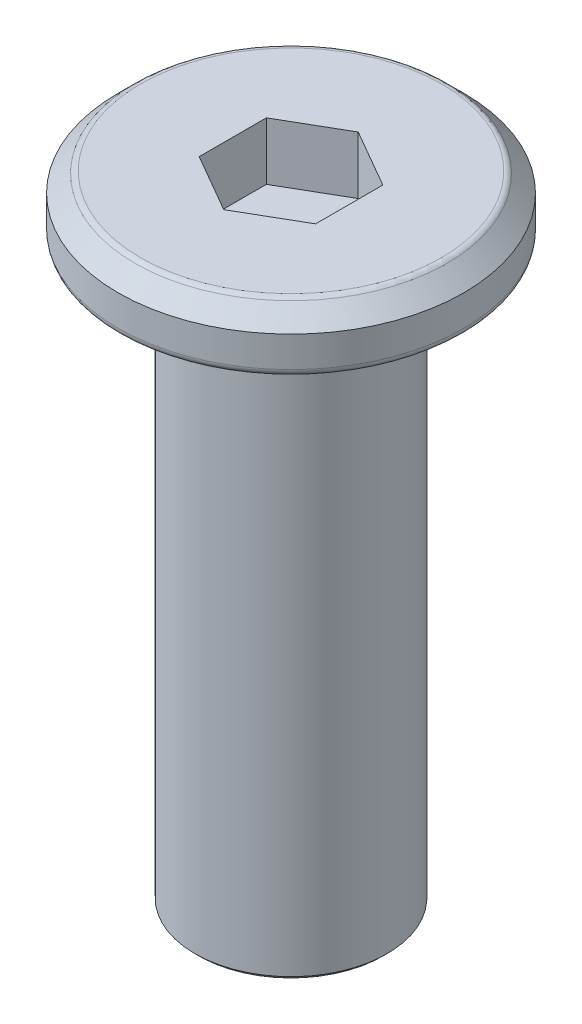
ISO-10303-21;
HEADER;
FILE_DESCRIPTION(('STEP AP214'),'2;1');
FILE_NAME('part.step','',(''),(''),'','','');
FILE_SCHEMA(('AUTOMOTIVE_DESIGN { 1 0 10303 214 1 1 1 1 }'));
ENDSEC;
DATA;
#1=APPLICATION_CONTEXT('core data for automotive mechanical design processes');
#2=APPLICATION_PROTOCOL_DEFINITION('international standard','automotive_design',2000,#1);
#3=PRODUCT_CONTEXT('',#1,'mechanical');
#4=PRODUCT('Part','Part','',(#3));
#5=PRODUCT_RELATED_PRODUCT_CATEGORY('part','',(#4));
#6=PRODUCT_DEFINITION_FORMATION('','',#4);
#7=PRODUCT_DEFINITION_CONTEXT('part definition',#1,'design');
#8=PRODUCT_DEFINITION('design','',#6,#7);
#9=PRODUCT_DEFINITION_SHAPE('','',#8);
#10=(LENGTH_UNIT() NAMED_UNIT(*) SI_UNIT(.MILLI.,.METRE.));
#11=(NAMED_UNIT(*) PLANE_ANGLE_UNIT() SI_UNIT($,.RADIAN.));
#12=(NAMED_UNIT(*) SI_UNIT($,.STERADIAN.) SOLID_ANGLE_UNIT());
#13=UNCERTAINTY_MEASURE_WITH_UNIT(LENGTH_MEASURE(1.E-05),#10,'distance_accuracy_value','');
#14=(GEOMETRIC_REPRESENTATION_CONTEXT(3) GLOBAL_UNCERTAINTY_ASSIGNED_CONTEXT((#13)) GLOBAL_UNIT_ASSIGNED_CONTEXT((#10,
#11,#12)) REPRESENTATION_CONTEXT('',''));
#15=CARTESIAN_POINT('',(0.,0.,0.));
#16=DIRECTION('',(0.,0.,1.));
#17=DIRECTION('',(1.,0.,0.));
#18=AXIS2_PLACEMENT_3D('',#15,#16,#17);
#19=CARTESIAN_POINT('',(0.,1.5,0.));
#20=DIRECTION('',(0.,-1.,0.));
#21=DIRECTION('',(0.,0.,-1.));
#22=AXIS2_PLACEMENT_3D('',#19,#20,#21);
#23=CYLINDRICAL_SURFACE('',#22,4.5);
#24=CARTESIAN_POINT('',(0.,0.2,0.));
#25=DIRECTION('',(0.,1.,0.));
#26=DIRECTION('',(0.,0.,1.));
#27=AXIS2_PLACEMENT_3D('',#24,#25,#26);
#28=CIRCLE('',#27,4.5);
#29=CARTESIAN_POINT('',(0.,0.2,4.5));
#30=VERTEX_POINT('',#29);
#31=EDGE_CURVE('E131',#30,#30,#28,.T.);
#32=ORIENTED_EDGE('',*,*,#31,.T.);
#33=EDGE_LOOP('',(#32));
#34=FACE_BOUND('',#33,.T.);
#35=CARTESIAN_POINT('',(0.,0.999999999999997,0.));
#36=DIRECTION('',(0.,1.,0.));
#37=DIRECTION('',(0.,0.,1.));
#38=AXIS2_PLACEMENT_3D('',#35,#36,#37);
#39=CIRCLE('',#38,4.5);
#40=CARTESIAN_POINT('',(0.,0.999999999999997,4.5));
#41=VERTEX_POINT('',#40);
#42=EDGE_CURVE('E117',#41,#41,#39,.F.);
#43=ORIENTED_EDGE('',*,*,#42,.T.);
#44=EDGE_LOOP('',(#43));
#45=FACE_BOUND('',#44,.T.);
#46=ADVANCED_FACE('F16',(#34,#45),#23,.T.);
#47=CARTESIAN_POINT('',(0.,1.5,0.));
#48=DIRECTION('',(0.,1.,0.));
#49=DIRECTION('',(0.,0.,1.));
#50=AXIS2_PLACEMENT_3D('',#47,#48,#49);
#51=PLANE('',#50);
#52=CARTESIAN_POINT('',(0.,1.5,0.));
#53=DIRECTION('',(0.,1.,0.));
#54=DIRECTION('',(0.,0.,1.));
#55=AXIS2_PLACEMENT_3D('',#52,#53,#54);
#56=CIRCLE('',#55,3.91715728752538);
#57=CARTESIAN_POINT('',(0.,1.5,3.91715728752538));
#58=VERTEX_POINT('',#57);
#59=EDGE_CURVE('E125',#58,#58,#56,.T.);
#60=ORIENTED_EDGE('',*,*,#59,.T.);
#61=EDGE_LOOP('',(#60));
#62=FACE_BOUND('',#61,.T.);
#63=DIRECTION('',(-0.866025403784438,0.,-0.5));
#64=VECTOR('',#63,1.);
#65=CARTESIAN_POINT('',(1.51554445662277,1.5,-0.875));
#66=LINE('',#65,#64);
#67=CARTESIAN_POINT('',(1.51554445662277,1.5,-0.875));
#68=VERTEX_POINT('',#67);
#69=CARTESIAN_POINT('',(0.,1.5,-1.75));
#70=VERTEX_POINT('',#69);
#71=EDGE_CURVE('E32',#68,#70,#66,.T.);
#72=ORIENTED_EDGE('',*,*,#71,.F.);
#73=DIRECTION('',(0.,0.,-1.));
#74=VECTOR('',#73,1.);
#75=CARTESIAN_POINT('',(1.51554445662277,1.5,0.875000000000001));
#76=LINE('',#75,#74);
#77=CARTESIAN_POINT('',(1.51554445662277,1.5,0.875000000000001));
#78=VERTEX_POINT('',#77);
#79=EDGE_CURVE('E113',#78,#68,#76,.T.);
#80=ORIENTED_EDGE('',*,*,#79,.F.);
#81=DIRECTION('',(0.866025403784439,0.,-0.5));
#82=VECTOR('',#81,1.);
#83=CARTESIAN_POINT('',(0.,1.5,1.75));
#84=LINE('',#83,#82);
#85=CARTESIAN_POINT('',(0.,1.5,1.75));
#86=VERTEX_POINT('',#85);
#87=EDGE_CURVE('E111',#86,#78,#84,.T.);
#88=ORIENTED_EDGE('',*,*,#87,.F.);
#89=DIRECTION('',(0.866025403784438,0.,0.5));
#90=VECTOR('',#89,1.);
#91=CARTESIAN_POINT('',(-1.51554445662277,1.5,0.874999999999999));
#92=LINE('',#91,#90);
#93=CARTESIAN_POINT('',(-1.51554445662277,1.5,0.874999999999999));
#94=VERTEX_POINT('',#93);
#95=EDGE_CURVE('E79',#94,#86,#92,.T.);
#96=ORIENTED_EDGE('',*,*,#95,.F.);
#97=DIRECTION('',(0.,0.,1.));
#98=VECTOR('',#97,1.);
#99=CARTESIAN_POINT('',(-1.51554445662277,1.5,-0.875));
#100=LINE('',#99,#98);
#101=CARTESIAN_POINT('',(-1.51554445662277,1.5,-0.875));
#102=VERTEX_POINT('',#101);
#103=EDGE_CURVE('E107',#102,#94,#100,.T.);
#104=ORIENTED_EDGE('',*,*,#103,.F.);
#105=DIRECTION('',(-0.866025403784439,0.,0.5));
#106=VECTOR('',#105,1.);
#107=CARTESIAN_POINT('',(0.,1.5,-1.75));
#108=LINE('',#107,#106);
#109=EDGE_CURVE('E104',#70,#102,#108,.T.);
#110=ORIENTED_EDGE('',*,*,#109,.F.);
#111=EDGE_LOOP('',(#72,#80,#88,#96,#104,#110));
#112=FACE_BOUND('',#111,.T.);
#113=ADVANCED_FACE('F158',(#62,#112),#51,.T.);
#114=CARTESIAN_POINT('',(0.,0.,0.));
#115=DIRECTION('',(0.,1.,0.));
#116=DIRECTION('',(0.,0.,1.));
#117=AXIS2_PLACEMENT_3D('',#114,#115,#116);
#118=PLANE('',#117);
#119=CARTESIAN_POINT('',(0.,0.,0.));
#120=DIRECTION('',(0.,1.,0.));
#121=DIRECTION('',(0.,0.,1.));
#122=AXIS2_PLACEMENT_3D('',#119,#120,#121);
#123=CIRCLE('',#122,2.75);
#124=CARTESIAN_POINT('',(0.,0.,2.75));
#125=VERTEX_POINT('',#124);
#126=EDGE_CURVE('E140',#125,#125,#123,.T.);
#127=ORIENTED_EDGE('',*,*,#126,.T.);
#128=EDGE_LOOP('',(#127));
#129=FACE_BOUND('',#128,.T.);
#130=CARTESIAN_POINT('',(0.,0.,0.));
#131=DIRECTION('',(0.,1.,0.));
#132=DIRECTION('',(0.,0.,1.));
#133=AXIS2_PLACEMENT_3D('',#130,#131,#132);
#134=CIRCLE('',#133,4.3);
#135=CARTESIAN_POINT('',(0.,0.,4.3));
#136=VERTEX_POINT('',#135);
#137=EDGE_CURVE('E134',#136,#136,#134,.F.);
#138=ORIENTED_EDGE('',*,*,#137,.T.);
#139=EDGE_LOOP('',(#138));
#140=FACE_BOUND('',#139,.T.);
#141=ADVANCED_FACE('F164',(#129,#140),#118,.F.);
#142=CARTESIAN_POINT('',(0.,1.5,0.));
#143=DIRECTION('',(0.,-1.,0.));
#144=DIRECTION('',(0.,0.,-1.));
#145=AXIS2_PLACEMENT_3D('',#142,#143,#144);
#146=CONICAL_SURFACE('',#145,4.,0.785398163397447);
#147=CARTESIAN_POINT('',(0.,1.44142135623731,0.));
#148=DIRECTION('',(0.,1.,0.));
#149=DIRECTION('',(0.,0.,1.));
#150=AXIS2_PLACEMENT_3D('',#147,#148,#149);
#151=CIRCLE('',#150,4.05857864376269);
#152=CARTESIAN_POINT('',(0.,1.44142135623731,4.05857864376269));
#153=VERTEX_POINT('',#152);
#154=EDGE_CURVE('E128',#153,#153,#151,.F.);
#155=ORIENTED_EDGE('',*,*,#154,.T.);
#156=EDGE_LOOP('',(#155));
#157=FACE_BOUND('',#156,.T.);
#158=ORIENTED_EDGE('',*,*,#42,.F.);
#159=EDGE_LOOP('',(#158));
#160=FACE_BOUND('',#159,.T.);
#161=ADVANCED_FACE('F170',(#157,#160),#146,.T.);
#162=CARTESIAN_POINT('',(1.51554445662277,0.,-0.875));
#163=DIRECTION('',(0.5,0.,-0.866025403784439));
#164=DIRECTION('',(-0.866025403784439,0.,-0.5));
#165=AXIS2_PLACEMENT_3D('',#162,#163,#164);
#166=PLANE('',#165);
#167=ORIENTED_EDGE('',*,*,#71,.T.);
#168=DIRECTION('',(0.,1.,0.));
#169=VECTOR('',#168,1.);
#170=CARTESIAN_POINT('',(0.,0.,-1.75));
#171=LINE('',#170,#169);
#172=CARTESIAN_POINT('',(0.,0.,-1.75));
#173=VERTEX_POINT('',#172);
#174=EDGE_CURVE('E63',#173,#70,#171,.T.);
#175=ORIENTED_EDGE('',*,*,#174,.F.);
#176=DIRECTION('',(-0.866025403784438,0.,-0.5));
#177=VECTOR('',#176,1.);
#178=CARTESIAN_POINT('',(1.51554445662277,0.,-0.875));
#179=LINE('',#178,#177);
#180=CARTESIAN_POINT('',(1.51554445662277,0.,-0.875));
#181=VERTEX_POINT('',#180);
#182=EDGE_CURVE('E115',#181,#173,#179,.T.);
#183=ORIENTED_EDGE('',*,*,#182,.F.);
#184=DIRECTION('',(0.,1.,0.));
#185=VECTOR('',#184,1.);
#186=CARTESIAN_POINT('',(1.51554445662277,0.,-0.875));
#187=LINE('',#186,#185);
#188=EDGE_CURVE('E40',#181,#68,#187,.T.);
#189=ORIENTED_EDGE('',*,*,#188,.T.);
#190=EDGE_LOOP('',(#167,#175,#183,#189));
#191=FACE_BOUND('',#190,.T.);
#192=ADVANCED_FACE('F173',(#191),#166,.F.);
#193=CARTESIAN_POINT('',(1.51554445662277,0.,0.875000000000001));
#194=DIRECTION('',(1.,0.,0.));
#195=DIRECTION('',(0.,0.,-1.));
#196=AXIS2_PLACEMENT_3D('',#193,#194,#195);
#197=PLANE('',#196);
#198=ORIENTED_EDGE('',*,*,#79,.T.);
#199=ORIENTED_EDGE('',*,*,#188,.F.);
#200=DIRECTION('',(0.,0.,-1.));
#201=VECTOR('',#200,1.);
#202=CARTESIAN_POINT('',(1.51554445662277,0.,0.875000000000001));
#203=LINE('',#202,#201);
#204=CARTESIAN_POINT('',(1.51554445662277,0.,0.875000000000001));
#205=VERTEX_POINT('',#204);
#206=EDGE_CURVE('E91',#205,#181,#203,.T.);
#207=ORIENTED_EDGE('',*,*,#206,.F.);
#208=DIRECTION('',(0.,1.,0.));
#209=VECTOR('',#208,1.);
#210=CARTESIAN_POINT('',(1.51554445662277,0.,0.875000000000001));
#211=LINE('',#210,#209);
#212=EDGE_CURVE('E83',#205,#78,#211,.T.);
#213=ORIENTED_EDGE('',*,*,#212,.T.);
#214=EDGE_LOOP('',(#198,#199,#207,#213));
#215=FACE_BOUND('',#214,.T.);
#216=ADVANCED_FACE('F207',(#215),#197,.F.);
#217=CARTESIAN_POINT('',(0.,0.,1.75));
#218=DIRECTION('',(0.5,0.,0.866025403784439));
#219=DIRECTION('',(0.866025403784439,0.,-0.5));
#220=AXIS2_PLACEMENT_3D('',#217,#218,#219);
#221=PLANE('',#220);
#222=ORIENTED_EDGE('',*,*,#87,.T.);
#223=ORIENTED_EDGE('',*,*,#212,.F.);
#224=DIRECTION('',(0.866025403784439,0.,-0.5));
#225=VECTOR('',#224,1.);
#226=CARTESIAN_POINT('',(0.,0.,1.75));
#227=LINE('',#226,#225);
#228=CARTESIAN_POINT('',(0.,0.,1.75));
#229=VERTEX_POINT('',#228);
#230=EDGE_CURVE('E87',#229,#205,#227,.T.);
#231=ORIENTED_EDGE('',*,*,#230,.F.);
#232=DIRECTION('',(0.,1.,0.));
#233=VECTOR('',#232,1.);
#234=CARTESIAN_POINT('',(0.,0.,1.75));
#235=LINE('',#234,#233);
#236=EDGE_CURVE('E72',#229,#86,#235,.T.);
#237=ORIENTED_EDGE('',*,*,#236,.T.);
#238=EDGE_LOOP('',(#222,#223,#231,#237));
#239=FACE_BOUND('',#238,.T.);
#240=ADVANCED_FACE('F88',(#239),#221,.F.);
#241=CARTESIAN_POINT('',(-1.51554445662277,0.,0.874999999999999));
#242=DIRECTION('',(-0.5,0.,0.866025403784438));
#243=DIRECTION('',(0.866025403784439,0.,0.5));
#244=AXIS2_PLACEMENT_3D('',#241,#242,#243);
#245=PLANE('',#244);
#246=ORIENTED_EDGE('',*,*,#95,.T.);
#247=ORIENTED_EDGE('',*,*,#236,.F.);
#248=DIRECTION('',(0.866025403784438,0.,0.5));
#249=VECTOR('',#248,1.);
#250=CARTESIAN_POINT('',(-1.51554445662277,0.,0.874999999999999));
#251=LINE('',#250,#249);
#252=CARTESIAN_POINT('',(-1.51554445662277,0.,0.874999999999999));
#253=VERTEX_POINT('',#252);
#254=EDGE_CURVE('E76',#253,#229,#251,.T.);
#255=ORIENTED_EDGE('',*,*,#254,.F.);
#256=DIRECTION('',(0.,1.,0.));
#257=VECTOR('',#256,1.);
#258=CARTESIAN_POINT('',(-1.51554445662277,0.,0.874999999999999));
#259=LINE('',#258,#257);
#260=EDGE_CURVE('E84',#253,#94,#259,.T.);
#261=ORIENTED_EDGE('',*,*,#260,.T.);
#262=EDGE_LOOP('',(#246,#247,#255,#261));
#263=FACE_BOUND('',#262,.T.);
#264=ADVANCED_FACE('F74',(#263),#245,.F.);
#265=CARTESIAN_POINT('',(-1.51554445662277,0.,-0.875));
#266=DIRECTION('',(-1.,0.,0.));
#267=DIRECTION('',(0.,0.,1.));
#268=AXIS2_PLACEMENT_3D('',#265,#266,#267);
#269=PLANE('',#268);
#270=ORIENTED_EDGE('',*,*,#103,.T.);
#271=ORIENTED_EDGE('',*,*,#260,.F.);
#272=DIRECTION('',(0.,0.,1.));
#273=VECTOR('',#272,1.);
#274=CARTESIAN_POINT('',(-1.51554445662277,0.,-0.875));
#275=LINE('',#274,#273);
#276=CARTESIAN_POINT('',(-1.51554445662277,0.,-0.875000000000001));
#277=VERTEX_POINT('',#276);
#278=EDGE_CURVE('E96',#277,#253,#275,.T.);
#279=ORIENTED_EDGE('',*,*,#278,.F.);
#280=DIRECTION('',(0.,1.,0.));
#281=VECTOR('',#280,1.);
#282=CARTESIAN_POINT('',(-1.51554445662277,0.,-0.875));
#283=LINE('',#282,#281);
#284=EDGE_CURVE('E120',#277,#102,#283,.T.);
#285=ORIENTED_EDGE('',*,*,#284,.T.);
#286=EDGE_LOOP('',(#270,#271,#279,#285));
#287=FACE_BOUND('',#286,.T.);
#288=ADVANCED_FACE('F214',(#287),#269,.F.);
#289=CARTESIAN_POINT('',(0.,0.,-1.75));
#290=DIRECTION('',(-0.5,0.,-0.866025403784439));
#291=DIRECTION('',(-0.866025403784439,0.,0.5));
#292=AXIS2_PLACEMENT_3D('',#289,#290,#291);
#293=PLANE('',#292);
#294=ORIENTED_EDGE('',*,*,#109,.T.);
#295=ORIENTED_EDGE('',*,*,#284,.F.);
#296=DIRECTION('',(-0.866025403784439,0.,0.5));
#297=VECTOR('',#296,1.);
#298=CARTESIAN_POINT('',(0.,0.,-1.75));
#299=LINE('',#298,#297);
#300=EDGE_CURVE('E98',#173,#277,#299,.T.);
#301=ORIENTED_EDGE('',*,*,#300,.F.);
#302=ORIENTED_EDGE('',*,*,#174,.T.);
#303=EDGE_LOOP('',(#294,#295,#301,#302));
#304=FACE_BOUND('',#303,.T.);
#305=ADVANCED_FACE('F204',(#304),#293,.F.);
#306=CARTESIAN_POINT('',(0.,0.,0.));
#307=DIRECTION('',(0.,-1.,0.));
#308=DIRECTION('',(0.,0.,-1.));
#309=AXIS2_PLACEMENT_3D('',#306,#307,#308);
#310=PLANE('',#309);
#311=ORIENTED_EDGE('',*,*,#206,.T.);
#312=ORIENTED_EDGE('',*,*,#182,.T.);
#313=ORIENTED_EDGE('',*,*,#300,.T.);
#314=ORIENTED_EDGE('',*,*,#278,.T.);
#315=ORIENTED_EDGE('',*,*,#254,.T.);
#316=ORIENTED_EDGE('',*,*,#230,.T.);
#317=EDGE_LOOP('',(#311,#312,#313,#314,#315,#316));
#318=FACE_BOUND('',#317,.T.);
#319=ADVANCED_FACE('F93',(#318),#310,.F.);
#320=CARTESIAN_POINT('',(0.,-15.,0.));
#321=DIRECTION('',(0.,1.,0.));
#322=DIRECTION('',(0.,0.,1.));
#323=AXIS2_PLACEMENT_3D('',#320,#321,#322);
#324=CYLINDRICAL_SURFACE('',#323,2.5);
#325=CARTESIAN_POINT('',(0.,-14.9,0.));
#326=DIRECTION('',(0.,-1.,0.));
#327=DIRECTION('',(0.,0.,-1.));
#328=AXIS2_PLACEMENT_3D('',#325,#326,#327);
#329=CIRCLE('',#328,2.5);
#330=CARTESIAN_POINT('',(0.,-14.9,-2.5));
#331=VERTEX_POINT('',#330);
#332=EDGE_CURVE('E10',#331,#331,#329,.F.);
#333=ORIENTED_EDGE('',*,*,#332,.T.);
#334=EDGE_LOOP('',(#333));
#335=FACE_BOUND('',#334,.T.);
#336=CARTESIAN_POINT('',(0.,-0.25,0.));
#337=DIRECTION('',(0.,1.,0.));
#338=DIRECTION('',(0.,0.,1.));
#339=AXIS2_PLACEMENT_3D('',#336,#337,#338);
#340=CIRCLE('',#339,2.5);
#341=CARTESIAN_POINT('',(0.,-0.25,2.5));
#342=VERTEX_POINT('',#341);
#343=EDGE_CURVE('E137',#342,#342,#340,.F.);
#344=ORIENTED_EDGE('',*,*,#343,.T.);
#345=EDGE_LOOP('',(#344));
#346=FACE_BOUND('',#345,.T.);
#347=ADVANCED_FACE('F195',(#335,#346),#324,.T.);
#348=CARTESIAN_POINT('',(0.,-15.,0.));
#349=DIRECTION('',(0.,-1.,0.));
#350=DIRECTION('',(0.,0.,-1.));
#351=AXIS2_PLACEMENT_3D('',#348,#349,#350);
#352=PLANE('',#351);
#353=CARTESIAN_POINT('',(0.,-15.,0.));
#354=DIRECTION('',(0.,-1.,0.));
#355=DIRECTION('',(0.,0.,-1.));
#356=AXIS2_PLACEMENT_3D('',#353,#354,#355);
#357=CIRCLE('',#356,2.4);
#358=CARTESIAN_POINT('',(0.,-15.,-2.4));
#359=VERTEX_POINT('',#358);
#360=EDGE_CURVE('E25',#359,#359,#357,.T.);
#361=ORIENTED_EDGE('',*,*,#360,.T.);
#362=EDGE_LOOP('',(#361));
#363=FACE_BOUND('',#362,.T.);
#364=ADVANCED_FACE('F145',(#363),#352,.T.);
#365=CARTESIAN_POINT('',(0.,1.3,0.));
#366=DIRECTION('',(0.,1.,0.));
#367=DIRECTION('',(0.,0.,1.));
#368=AXIS2_PLACEMENT_3D('',#365,#366,#367);
#369=TOROIDAL_SURFACE('',#368,3.91715728752538,0.2);
#370=ORIENTED_EDGE('',*,*,#154,.F.);
#371=EDGE_LOOP('',(#370));
#372=FACE_BOUND('',#371,.T.);
#373=ORIENTED_EDGE('',*,*,#59,.F.);
#374=EDGE_LOOP('',(#373));
#375=FACE_BOUND('',#374,.T.);
#376=ADVANCED_FACE('F175',(#372,#375),#369,.T.);
#377=CARTESIAN_POINT('',(0.,0.2,0.));
#378=DIRECTION('',(0.,1.,0.));
#379=DIRECTION('',(0.,0.,1.));
#380=AXIS2_PLACEMENT_3D('',#377,#378,#379);
#381=TOROIDAL_SURFACE('',#380,4.3,0.2);
#382=ORIENTED_EDGE('',*,*,#137,.F.);
#383=EDGE_LOOP('',(#382));
#384=FACE_BOUND('',#383,.T.);
#385=ORIENTED_EDGE('',*,*,#31,.F.);
#386=EDGE_LOOP('',(#385));
#387=FACE_BOUND('',#386,.T.);
#388=ADVANCED_FACE('F154',(#384,#387),#381,.T.);
#389=CARTESIAN_POINT('',(0.,-0.25,0.));
#390=DIRECTION('',(0.,1.,0.));
#391=DIRECTION('',(0.,0.,1.));
#392=AXIS2_PLACEMENT_3D('',#389,#390,#391);
#393=TOROIDAL_SURFACE('',#392,2.75,0.25);
#394=ORIENTED_EDGE('',*,*,#126,.F.);
#395=EDGE_LOOP('',(#394));
#396=FACE_BOUND('',#395,.T.);
#397=ORIENTED_EDGE('',*,*,#343,.F.);
#398=EDGE_LOOP('',(#397));
#399=FACE_BOUND('',#398,.T.);
#400=ADVANCED_FACE('F148',(#396,#399),#393,.F.);
#401=CARTESIAN_POINT('',(0.,-15.,0.));
#402=DIRECTION('',(0.,1.,0.));
#403=DIRECTION('',(0.,0.,1.));
#404=AXIS2_PLACEMENT_3D('',#401,#402,#403);
#405=CONICAL_SURFACE('',#404,2.4,0.785398163397463);
#406=ORIENTED_EDGE('',*,*,#332,.F.);
#407=EDGE_LOOP('',(#406));
#408=FACE_BOUND('',#407,.T.);
#409=ORIENTED_EDGE('',*,*,#360,.F.);
#410=EDGE_LOOP('',(#409));
#411=FACE_BOUND('',#410,.T.);
#412=ADVANCED_FACE('F19',(#408,#411),#405,.T.);
#413=CLOSED_SHELL('',(#46,#113,#141,#161,#192,#216,#240,#264,#288,#305,#319,#347,#364,#376,#388,
#400,#412));
#414=MANIFOLD_SOLID_BREP('B1',#413);
#415=ADVANCED_BREP_SHAPE_REPRESENTATION('',(#18,#414),#14);
#416=SHAPE_DEFINITION_REPRESENTATION(#9,#415);
ENDSEC;
END-ISO-10303-21;
